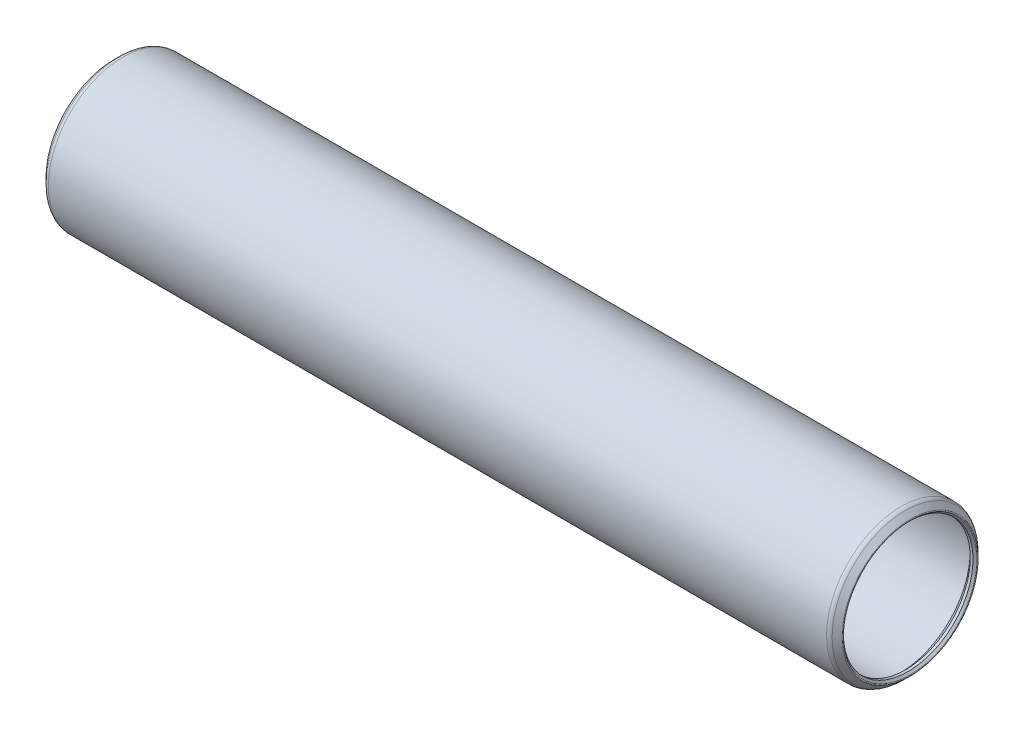
ISO-10303-21;
HEADER;
FILE_DESCRIPTION(('STEP AP214'),'2;1');
FILE_NAME('part.step','',(''),(''),'','','');
FILE_SCHEMA(('AUTOMOTIVE_DESIGN { 1 0 10303 214 1 1 1 1 }'));
ENDSEC;
DATA;
#1=APPLICATION_CONTEXT('core data for automotive mechanical design processes');
#2=APPLICATION_PROTOCOL_DEFINITION('international standard','automotive_design',2000,#1);
#3=PRODUCT_CONTEXT('',#1,'mechanical');
#4=PRODUCT('Part','Part','',(#3));
#5=PRODUCT_RELATED_PRODUCT_CATEGORY('part','',(#4));
#6=PRODUCT_DEFINITION_FORMATION('','',#4);
#7=PRODUCT_DEFINITION_CONTEXT('part definition',#1,'design');
#8=PRODUCT_DEFINITION('design','',#6,#7);
#9=PRODUCT_DEFINITION_SHAPE('','',#8);
#10=(LENGTH_UNIT() NAMED_UNIT(*) SI_UNIT(.MILLI.,.METRE.));
#11=(NAMED_UNIT(*) PLANE_ANGLE_UNIT() SI_UNIT($,.RADIAN.));
#12=(NAMED_UNIT(*) SI_UNIT($,.STERADIAN.) SOLID_ANGLE_UNIT());
#13=UNCERTAINTY_MEASURE_WITH_UNIT(LENGTH_MEASURE(1.E-05),#10,'distance_accuracy_value','');
#14=(GEOMETRIC_REPRESENTATION_CONTEXT(3) GLOBAL_UNCERTAINTY_ASSIGNED_CONTEXT((#13)) GLOBAL_UNIT_ASSIGNED_CONTEXT((#10,
#11,#12)) REPRESENTATION_CONTEXT('',''));
#15=CARTESIAN_POINT('',(0.,0.,0.));
#16=DIRECTION('',(0.,0.,1.));
#17=DIRECTION('',(1.,0.,0.));
#18=AXIS2_PLACEMENT_3D('',#15,#16,#17);
#19=CARTESIAN_POINT('',(-0.549710244842875,0.,0.));
#20=DIRECTION('',(-1.,0.,0.));
#21=DIRECTION('',(0.,0.,1.));
#22=AXIS2_PLACEMENT_3D('',#19,#20,#21);
#23=TOROIDAL_SURFACE('',#22,9.25736536726415,0.126999999999895);
#24=CARTESIAN_POINT('',(-0.639512806053455,0.,0.));
#25=DIRECTION('',(-1.,0.,0.));
#26=DIRECTION('',(0.,0.,1.));
#27=AXIS2_PLACEMENT_3D('',#24,#25,#26);
#28=CIRCLE('',#27,9.1675628060535);
#29=CARTESIAN_POINT('',(-0.639512806053455,0.,9.1675628060535));
#30=VERTEX_POINT('',#29);
#31=EDGE_CURVE('E10',#30,#30,#28,.T.);
#32=ORIENTED_EDGE('',*,*,#31,.F.);
#33=EDGE_LOOP('',(#32));
#34=FACE_BOUND('',#33,.T.);
#35=CARTESIAN_POINT('',(-0.639512806053455,0.,0.));
#36=DIRECTION('',(-1.,0.,0.));
#37=DIRECTION('',(0.,0.,1.));
#38=AXIS2_PLACEMENT_3D('',#35,#36,#37);
#39=CIRCLE('',#38,9.3471679284748);
#40=CARTESIAN_POINT('',(-0.639512806053455,0.,9.3471679284748));
#41=VERTEX_POINT('',#40);
#42=EDGE_CURVE('E78',#41,#41,#39,.T.);
#43=ORIENTED_EDGE('',*,*,#42,.T.);
#44=EDGE_LOOP('',(#43));
#45=FACE_BOUND('',#44,.T.);
#46=ADVANCED_FACE('F32',(#34,#45),#23,.T.);
#47=CARTESIAN_POINT('',(-0.639512806053455,0.,0.));
#48=DIRECTION('',(-1.,0.,0.));
#49=DIRECTION('',(0.,0.,1.));
#50=AXIS2_PLACEMENT_3D('',#47,#48,#49);
#51=CONICAL_SURFACE('',#50,9.1675628060535,0.785398163397549);
#52=CARTESIAN_POINT('',(-0.381000000000006,0.,0.));
#53=DIRECTION('',(-1.,0.,0.));
#54=DIRECTION('',(0.,0.,1.));
#55=AXIS2_PLACEMENT_3D('',#52,#53,#54);
#56=CIRCLE('',#55,8.90905);
#57=CARTESIAN_POINT('',(-0.381000000000006,0.,8.90905));
#58=VERTEX_POINT('',#57);
#59=EDGE_CURVE('E38',#58,#58,#56,.T.);
#60=ORIENTED_EDGE('',*,*,#59,.F.);
#61=EDGE_LOOP('',(#60));
#62=FACE_BOUND('',#61,.T.);
#63=ORIENTED_EDGE('',*,*,#31,.T.);
#64=EDGE_LOOP('',(#63));
#65=FACE_BOUND('',#64,.T.);
#66=ADVANCED_FACE('F151',(#62,#65),#51,.F.);
#67=CARTESIAN_POINT('',(108.0897,0.,0.));
#68=DIRECTION('',(-1.,0.,0.));
#69=DIRECTION('',(0.,0.,1.));
#70=AXIS2_PLACEMENT_3D('',#67,#68,#69);
#71=CYLINDRICAL_SURFACE('',#70,8.90905);
#72=CARTESIAN_POINT('',(0.,0.,0.));
#73=DIRECTION('',(-1.,0.,0.));
#74=DIRECTION('',(0.,0.,1.));
#75=AXIS2_PLACEMENT_3D('',#72,#73,#74);
#76=CIRCLE('',#75,8.90905);
#77=CARTESIAN_POINT('',(0.,0.,8.90905));
#78=VERTEX_POINT('',#77);
#79=EDGE_CURVE('E42',#78,#78,#76,.T.);
#80=ORIENTED_EDGE('',*,*,#79,.F.);
#81=EDGE_LOOP('',(#80));
#82=FACE_BOUND('',#81,.T.);
#83=ORIENTED_EDGE('',*,*,#59,.T.);
#84=EDGE_LOOP('',(#83));
#85=FACE_BOUND('',#84,.T.);
#86=ADVANCED_FACE('F146',(#82,#85),#71,.F.);
#87=CARTESIAN_POINT('',(0.,0.,0.));
#88=DIRECTION('',(1.,0.,0.));
#89=DIRECTION('',(0.,0.,-1.));
#90=AXIS2_PLACEMENT_3D('',#87,#88,#89);
#91=CONICAL_SURFACE('',#90,8.90905,0.785398163397448);
#92=CARTESIAN_POINT('',(0.761999999999999,0.,0.));
#93=DIRECTION('',(-1.,0.,0.));
#94=DIRECTION('',(0.,0.,1.));
#95=AXIS2_PLACEMENT_3D('',#92,#93,#94);
#96=CIRCLE('',#95,9.67105);
#97=CARTESIAN_POINT('',(0.761999999999999,0.,9.67105));
#98=VERTEX_POINT('',#97);
#99=EDGE_CURVE('E46',#98,#98,#96,.T.);
#100=ORIENTED_EDGE('',*,*,#99,.F.);
#101=EDGE_LOOP('',(#100));
#102=FACE_BOUND('',#101,.T.);
#103=ORIENTED_EDGE('',*,*,#79,.T.);
#104=EDGE_LOOP('',(#103));
#105=FACE_BOUND('',#104,.T.);
#106=ADVANCED_FACE('F140',(#102,#105),#91,.F.);
#107=CARTESIAN_POINT('',(108.0897,0.,0.));
#108=DIRECTION('',(-1.,0.,0.));
#109=DIRECTION('',(0.,0.,1.));
#110=AXIS2_PLACEMENT_3D('',#107,#108,#109);
#111=CYLINDRICAL_SURFACE('',#110,9.67105);
#112=CARTESIAN_POINT('',(107.3277,0.,0.));
#113=DIRECTION('',(-1.,0.,0.));
#114=DIRECTION('',(0.,0.,1.));
#115=AXIS2_PLACEMENT_3D('',#112,#113,#114);
#116=CIRCLE('',#115,9.67105);
#117=CARTESIAN_POINT('',(107.3277,0.,9.67105));
#118=VERTEX_POINT('',#117);
#119=EDGE_CURVE('E51',#118,#118,#116,.T.);
#120=ORIENTED_EDGE('',*,*,#119,.F.);
#121=EDGE_LOOP('',(#120));
#122=FACE_BOUND('',#121,.T.);
#123=ORIENTED_EDGE('',*,*,#99,.T.);
#124=EDGE_LOOP('',(#123));
#125=FACE_BOUND('',#124,.T.);
#126=ADVANCED_FACE('F134',(#122,#125),#111,.F.);
#127=CARTESIAN_POINT('',(107.3277,0.,0.));
#128=DIRECTION('',(-1.,0.,0.));
#129=DIRECTION('',(0.,0.,1.));
#130=AXIS2_PLACEMENT_3D('',#127,#128,#129);
#131=CONICAL_SURFACE('',#130,9.67105,0.785398163397448);
#132=CARTESIAN_POINT('',(108.0897,0.,0.));
#133=DIRECTION('',(-1.,0.,0.));
#134=DIRECTION('',(0.,0.,1.));
#135=AXIS2_PLACEMENT_3D('',#132,#133,#134);
#136=CIRCLE('',#135,8.90905);
#137=CARTESIAN_POINT('',(108.0897,0.,8.90905));
#138=VERTEX_POINT('',#137);
#139=EDGE_CURVE('E54',#138,#138,#136,.T.);
#140=ORIENTED_EDGE('',*,*,#139,.F.);
#141=EDGE_LOOP('',(#140));
#142=FACE_BOUND('',#141,.T.);
#143=ORIENTED_EDGE('',*,*,#119,.T.);
#144=EDGE_LOOP('',(#143));
#145=FACE_BOUND('',#144,.T.);
#146=ADVANCED_FACE('F128',(#142,#145),#131,.F.);
#147=CARTESIAN_POINT('',(108.0897,0.,0.));
#148=DIRECTION('',(-1.,0.,0.));
#149=DIRECTION('',(0.,0.,1.));
#150=AXIS2_PLACEMENT_3D('',#147,#148,#149);
#151=CYLINDRICAL_SURFACE('',#150,8.90905);
#152=CARTESIAN_POINT('',(108.4707,0.,0.));
#153=DIRECTION('',(-1.,0.,0.));
#154=DIRECTION('',(0.,0.,1.));
#155=AXIS2_PLACEMENT_3D('',#152,#153,#154);
#156=CIRCLE('',#155,8.90905);
#157=CARTESIAN_POINT('',(108.4707,0.,8.90905));
#158=VERTEX_POINT('',#157);
#159=EDGE_CURVE('E57',#158,#158,#156,.T.);
#160=ORIENTED_EDGE('',*,*,#159,.F.);
#161=EDGE_LOOP('',(#160));
#162=FACE_BOUND('',#161,.T.);
#163=ORIENTED_EDGE('',*,*,#139,.T.);
#164=EDGE_LOOP('',(#163));
#165=FACE_BOUND('',#164,.T.);
#166=ADVANCED_FACE('F122',(#162,#165),#151,.F.);
#167=CARTESIAN_POINT('',(108.4707,0.,0.));
#168=DIRECTION('',(1.,0.,0.));
#169=DIRECTION('',(0.,0.,-1.));
#170=AXIS2_PLACEMENT_3D('',#167,#168,#169);
#171=CONICAL_SURFACE('',#170,8.90905,0.785398163397422);
#172=CARTESIAN_POINT('',(108.729212806052,0.,0.));
#173=DIRECTION('',(-1.,0.,0.));
#174=DIRECTION('',(0.,0.,1.));
#175=AXIS2_PLACEMENT_3D('',#172,#173,#174);
#176=CIRCLE('',#175,9.1675628060517);
#177=CARTESIAN_POINT('',(108.729212806052,0.,9.1675628060517));
#178=VERTEX_POINT('',#177);
#179=EDGE_CURVE('E60',#178,#178,#176,.T.);
#180=ORIENTED_EDGE('',*,*,#179,.F.);
#181=EDGE_LOOP('',(#180));
#182=FACE_BOUND('',#181,.T.);
#183=ORIENTED_EDGE('',*,*,#159,.T.);
#184=EDGE_LOOP('',(#183));
#185=FACE_BOUND('',#184,.T.);
#186=ADVANCED_FACE('F116',(#182,#185),#171,.F.);
#187=CARTESIAN_POINT('',(108.639410244843,0.,0.));
#188=DIRECTION('',(-1.,0.,0.));
#189=DIRECTION('',(0.,0.,1.));
#190=AXIS2_PLACEMENT_3D('',#187,#188,#189);
#191=TOROIDAL_SURFACE('',#190,9.25736536726203,0.126999999998339);
#192=CARTESIAN_POINT('',(108.729212806052,0.,0.));
#193=DIRECTION('',(-1.,0.,0.));
#194=DIRECTION('',(0.,0.,1.));
#195=AXIS2_PLACEMENT_3D('',#192,#193,#194);
#196=CIRCLE('',#195,9.34716792847174);
#197=CARTESIAN_POINT('',(108.729212806052,0.,9.34716792847174));
#198=VERTEX_POINT('',#197);
#199=EDGE_CURVE('E63',#198,#198,#196,.T.);
#200=ORIENTED_EDGE('',*,*,#199,.F.);
#201=EDGE_LOOP('',(#200));
#202=FACE_BOUND('',#201,.T.);
#203=ORIENTED_EDGE('',*,*,#179,.T.);
#204=EDGE_LOOP('',(#203));
#205=FACE_BOUND('',#204,.T.);
#206=ADVANCED_FACE('F110',(#202,#205),#191,.T.);
#207=CARTESIAN_POINT('',(108.729212806052,0.,0.));
#208=DIRECTION('',(-1.,0.,0.));
#209=DIRECTION('',(0.,0.,1.));
#210=AXIS2_PLACEMENT_3D('',#207,#208,#209);
#211=CONICAL_SURFACE('',#210,9.34716792847174,0.78539816339745);
#212=CARTESIAN_POINT('',(108.044315367256,0.,0.));
#213=DIRECTION('',(-1.,0.,0.));
#214=DIRECTION('',(0.,0.,1.));
#215=AXIS2_PLACEMENT_3D('',#212,#213,#214);
#216=CIRCLE('',#215,10.0320653672684);
#217=CARTESIAN_POINT('',(108.044315367256,0.,10.0320653672684));
#218=VERTEX_POINT('',#217);
#219=EDGE_CURVE('E66',#218,#218,#216,.T.);
#220=ORIENTED_EDGE('',*,*,#219,.F.);
#221=EDGE_LOOP('',(#220));
#222=FACE_BOUND('',#221,.T.);
#223=ORIENTED_EDGE('',*,*,#199,.T.);
#224=EDGE_LOOP('',(#223));
#225=FACE_BOUND('',#224,.T.);
#226=ADVANCED_FACE('F104',(#222,#225),#211,.T.);
#227=CARTESIAN_POINT('',(107.505500000002,0.,0.));
#228=DIRECTION('',(-1.,0.,0.));
#229=DIRECTION('',(0.,0.,1.));
#230=AXIS2_PLACEMENT_3D('',#227,#228,#229);
#231=TOROIDAL_SURFACE('',#230,9.49325000001424,0.761999999985815);
#232=CARTESIAN_POINT('',(107.505500000002,0.,0.));
#233=DIRECTION('',(-1.,0.,0.));
#234=DIRECTION('',(0.,0.,1.));
#235=AXIS2_PLACEMENT_3D('',#232,#233,#234);
#236=CIRCLE('',#235,10.2552500000001);
#237=CARTESIAN_POINT('',(107.505500000002,0.,10.2552500000001));
#238=VERTEX_POINT('',#237);
#239=EDGE_CURVE('E69',#238,#238,#236,.T.);
#240=ORIENTED_EDGE('',*,*,#239,.F.);
#241=EDGE_LOOP('',(#240));
#242=FACE_BOUND('',#241,.T.);
#243=ORIENTED_EDGE('',*,*,#219,.T.);
#244=EDGE_LOOP('',(#243));
#245=FACE_BOUND('',#244,.T.);
#246=ADVANCED_FACE('F98',(#242,#245),#231,.T.);
#247=CARTESIAN_POINT('',(108.0897,0.,0.));
#248=DIRECTION('',(-1.,0.,0.));
#249=DIRECTION('',(0.,0.,1.));
#250=AXIS2_PLACEMENT_3D('',#247,#248,#249);
#251=CYLINDRICAL_SURFACE('',#250,10.2552500000001);
#252=CARTESIAN_POINT('',(0.584199999997925,0.,0.));
#253=DIRECTION('',(-1.,0.,0.));
#254=DIRECTION('',(0.,0.,1.));
#255=AXIS2_PLACEMENT_3D('',#252,#253,#254);
#256=CIRCLE('',#255,10.2552500000001);
#257=CARTESIAN_POINT('',(0.584199999997925,0.,10.2552500000001));
#258=VERTEX_POINT('',#257);
#259=EDGE_CURVE('E72',#258,#258,#256,.T.);
#260=ORIENTED_EDGE('',*,*,#259,.F.);
#261=EDGE_LOOP('',(#260));
#262=FACE_BOUND('',#261,.T.);
#263=ORIENTED_EDGE('',*,*,#239,.T.);
#264=EDGE_LOOP('',(#263));
#265=FACE_BOUND('',#264,.T.);
#266=ADVANCED_FACE('F92',(#262,#265),#251,.T.);
#267=CARTESIAN_POINT('',(0.584199999997987,0.,0.));
#268=DIRECTION('',(-1.,0.,0.));
#269=DIRECTION('',(0.,0.,1.));
#270=AXIS2_PLACEMENT_3D('',#267,#268,#269);
#271=TOROIDAL_SURFACE('',#270,9.49325000000522,0.761999999994844);
#272=CARTESIAN_POINT('',(0.0453846327374691,0.,0.));
#273=DIRECTION('',(-1.,0.,0.));
#274=DIRECTION('',(0.,0.,1.));
#275=AXIS2_PLACEMENT_3D('',#272,#273,#274);
#276=CIRCLE('',#275,10.0320653672657);
#277=CARTESIAN_POINT('',(0.0453846327374691,0.,10.0320653672657));
#278=VERTEX_POINT('',#277);
#279=EDGE_CURVE('E75',#278,#278,#276,.T.);
#280=ORIENTED_EDGE('',*,*,#279,.F.);
#281=EDGE_LOOP('',(#280));
#282=FACE_BOUND('',#281,.T.);
#283=ORIENTED_EDGE('',*,*,#259,.T.);
#284=EDGE_LOOP('',(#283));
#285=FACE_BOUND('',#284,.T.);
#286=ADVANCED_FACE('F86',(#282,#285),#271,.T.);
#287=CARTESIAN_POINT('',(0.0453846327374691,0.,0.));
#288=DIRECTION('',(1.,0.,0.));
#289=DIRECTION('',(0.,0.,-1.));
#290=AXIS2_PLACEMENT_3D('',#287,#288,#289);
#291=CONICAL_SURFACE('',#290,10.0320653672657,0.785398163397456);
#292=ORIENTED_EDGE('',*,*,#42,.F.);
#293=EDGE_LOOP('',(#292));
#294=FACE_BOUND('',#293,.T.);
#295=ORIENTED_EDGE('',*,*,#279,.T.);
#296=EDGE_LOOP('',(#295));
#297=FACE_BOUND('',#296,.T.);
#298=ADVANCED_FACE('F83',(#294,#297),#291,.T.);
#299=CLOSED_SHELL('',(#46,#66,#86,#106,#126,#146,#166,#186,#206,#226,#246,#266,#286,#298));
#300=MANIFOLD_SOLID_BREP('B2',#299);
#301=ADVANCED_BREP_SHAPE_REPRESENTATION('',(#18,#300),#14);
#302=SHAPE_DEFINITION_REPRESENTATION(#9,#301);
ENDSEC;
END-ISO-10303-21;
